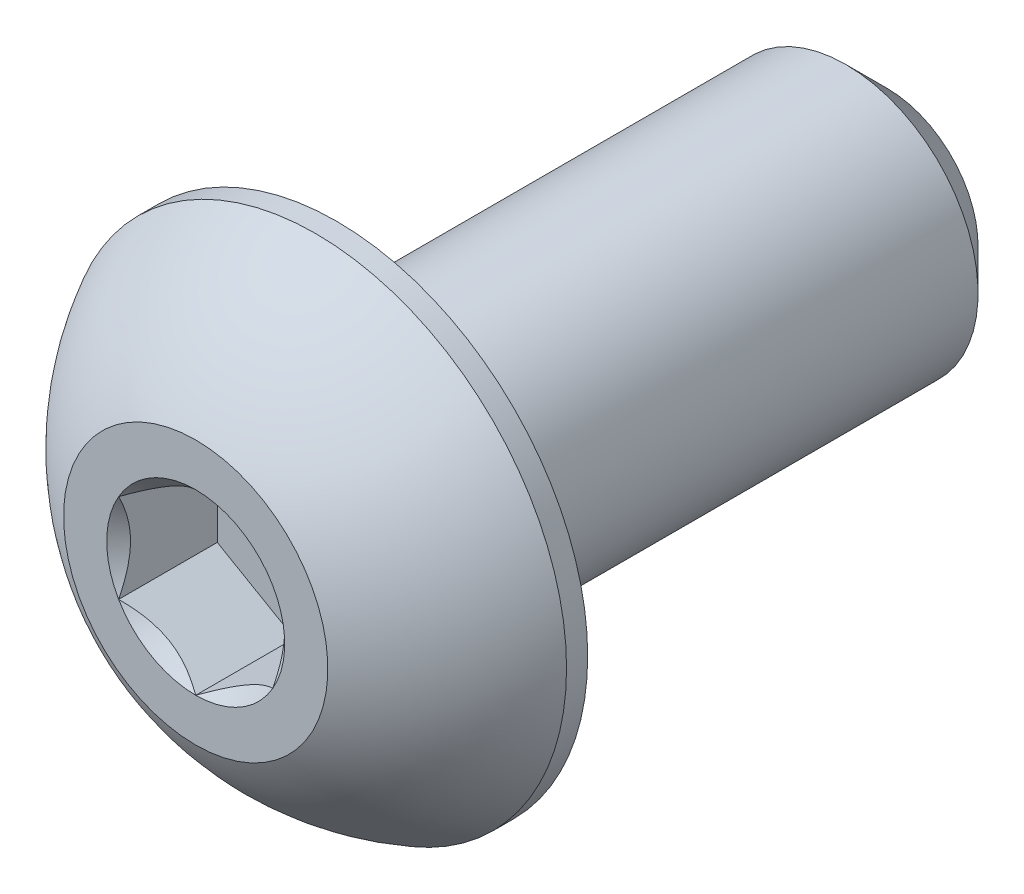
ISO-10303-21;
HEADER;
FILE_DESCRIPTION(('STEP AP214'),'2;1');
FILE_NAME('part.step','',(''),(''),'','','');
FILE_SCHEMA(('AUTOMOTIVE_DESIGN { 1 0 10303 214 1 1 1 1 }'));
ENDSEC;
DATA;
#1=APPLICATION_CONTEXT('core data for automotive mechanical design processes');
#2=APPLICATION_PROTOCOL_DEFINITION('international standard','automotive_design',2000,#1);
#3=PRODUCT_CONTEXT('',#1,'mechanical');
#4=PRODUCT('Part','Part','',(#3));
#5=PRODUCT_RELATED_PRODUCT_CATEGORY('part','',(#4));
#6=PRODUCT_DEFINITION_FORMATION('','',#4);
#7=PRODUCT_DEFINITION_CONTEXT('part definition',#1,'design');
#8=PRODUCT_DEFINITION('design','',#6,#7);
#9=PRODUCT_DEFINITION_SHAPE('','',#8);
#10=(LENGTH_UNIT() NAMED_UNIT(*) SI_UNIT(.MILLI.,.METRE.));
#11=(NAMED_UNIT(*) PLANE_ANGLE_UNIT() SI_UNIT($,.RADIAN.));
#12=(NAMED_UNIT(*) SI_UNIT($,.STERADIAN.) SOLID_ANGLE_UNIT());
#13=UNCERTAINTY_MEASURE_WITH_UNIT(LENGTH_MEASURE(1.E-05),#10,'distance_accuracy_value','');
#14=(GEOMETRIC_REPRESENTATION_CONTEXT(3) GLOBAL_UNCERTAINTY_ASSIGNED_CONTEXT((#13)) GLOBAL_UNIT_ASSIGNED_CONTEXT((#10,
#11,#12)) REPRESENTATION_CONTEXT('',''));
#15=CARTESIAN_POINT('',(0.,0.,0.));
#16=DIRECTION('',(0.,0.,1.));
#17=DIRECTION('',(1.,0.,0.));
#18=AXIS2_PLACEMENT_3D('',#15,#16,#17);
#19=CARTESIAN_POINT('',(0.,-0.762000000000003,-3.9878));
#20=DIRECTION('',(0.,0.,-1.));
#21=DIRECTION('',(0.,1.,0.));
#22=AXIS2_PLACEMENT_3D('',#19,#20,#21);
#23=PLANE('',#22);
#24=CARTESIAN_POINT('',(0.,0.,-3.9878));
#25=DIRECTION('',(0.,0.,-1.));
#26=DIRECTION('',(0.,1.,0.));
#27=AXIS2_PLACEMENT_3D('',#24,#25,#26);
#28=CIRCLE('',#27,0.523875000000002);
#29=CARTESIAN_POINT('',(0.,0.523875000000001,-3.9878));
#30=VERTEX_POINT('',#29);
#31=EDGE_CURVE('E174',#30,#30,#28,.T.);
#32=ORIENTED_EDGE('',*,*,#31,.T.);
#33=EDGE_LOOP('',(#32));
#34=FACE_BOUND('',#33,.T.);
#35=ADVANCED_FACE('F35',(#34),#23,.T.);
#36=CARTESIAN_POINT('',(0.,0.,-3.9878));
#37=DIRECTION('',(0.,0.,-1.));
#38=DIRECTION('',(0.,1.,0.));
#39=AXIS2_PLACEMENT_3D('',#36,#37,#38);
#40=CYLINDRICAL_SURFACE('',#39,0.762000000000002);
#41=CARTESIAN_POINT('',(0.,0.,-3.749675));
#42=DIRECTION('',(0.,0.,-1.));
#43=DIRECTION('',(0.,1.,0.));
#44=AXIS2_PLACEMENT_3D('',#41,#42,#43);
#45=CIRCLE('',#44,0.762000000000002);
#46=CARTESIAN_POINT('',(0.,0.762000000000001,-3.749675));
#47=VERTEX_POINT('',#46);
#48=EDGE_CURVE('E48',#47,#47,#45,.F.);
#49=ORIENTED_EDGE('',*,*,#48,.T.);
#50=EDGE_LOOP('',(#49));
#51=FACE_BOUND('',#50,.T.);
#52=CARTESIAN_POINT('',(0.,0.,-0.8128));
#53=DIRECTION('',(0.,0.,1.));
#54=DIRECTION('',(1.,0.,0.));
#55=AXIS2_PLACEMENT_3D('',#52,#53,#54);
#56=CIRCLE('',#55,0.762000000000002);
#57=CARTESIAN_POINT('',(0.762000000000002,0.,-0.8128));
#58=VERTEX_POINT('',#57);
#59=EDGE_CURVE('E171',#58,#58,#56,.F.);
#60=ORIENTED_EDGE('',*,*,#59,.T.);
#61=EDGE_LOOP('',(#60));
#62=FACE_BOUND('',#61,.T.);
#63=ADVANCED_FACE('F179',(#51,#62),#40,.T.);
#64=CARTESIAN_POINT('',(0.,0.,-3.9878));
#65=DIRECTION('',(0.,0.,1.));
#66=DIRECTION('',(0.,-1.,0.));
#67=AXIS2_PLACEMENT_3D('',#64,#65,#66);
#68=CONICAL_SURFACE('',#67,0.523875000000002,0.785398163397446);
#69=ORIENTED_EDGE('',*,*,#48,.F.);
#70=EDGE_LOOP('',(#69));
#71=FACE_BOUND('',#70,.T.);
#72=ORIENTED_EDGE('',*,*,#31,.F.);
#73=EDGE_LOOP('',(#72));
#74=FACE_BOUND('',#73,.T.);
#75=ADVANCED_FACE('F37',(#71,#74),#68,.T.);
#76=CARTESIAN_POINT('',(0.,0.,-1.44221573529412));
#77=DIRECTION('',(0.,0.,1.));
#78=DIRECTION('',(0.,-1.,0.));
#79=AXIS2_PLACEMENT_3D('',#76,#77,#78);
#80=SPHERICAL_SURFACE('',#79,1.63114384011035);
#81=CARTESIAN_POINT('',(0.,0.,0.));
#82=DIRECTION('',(0.,0.,1.));
#83=DIRECTION('',(1.,0.,0.));
#84=AXIS2_PLACEMENT_3D('',#81,#82,#83);
#85=CIRCLE('',#84,0.762000000000001);
#86=CARTESIAN_POINT('',(0.,-0.762000000000001,0.));
#87=VERTEX_POINT('',#86);
#88=EDGE_CURVE('E168',#87,#87,#85,.T.);
#89=CARTESIAN_POINT('',(0.,0.,-0.69088));
#90=DIRECTION('',(0.,0.,1.));
#91=DIRECTION('',(1.,0.,0.));
#92=AXIS2_PLACEMENT_3D('',#89,#90,#91);
#93=CIRCLE('',#92,1.4478);
#94=CARTESIAN_POINT('',(0.,-1.4478,-0.69088));
#95=VERTEX_POINT('',#94);
#96=EDGE_CURVE('E162',#95,#95,#93,.T.);
#97=CARTESIAN_POINT('',(0.,-0.762000000000001,0.));
#98=CARTESIAN_POINT('',(0.,-0.771104466379056,-0.00481036417026989));
#99=CARTESIAN_POINT('',(0.,-0.780163370263474,-0.00970696229692556));
#100=CARTESIAN_POINT('',(0.,-0.798186830704756,-0.0196708219968889));
#101=CARTESIAN_POINT('',(0.,-0.807151387261621,-0.0247380835701966));
#102=CARTESIAN_POINT('',(0.,-0.82498293070952,-0.0350414656973441));
#103=CARTESIAN_POINT('',(0.,-0.833849917600554,-0.0402775862511838));
#104=CARTESIAN_POINT('',(0.,-0.851483143439324,-0.0509168049100707));
#105=CARTESIAN_POINT('',(0.,-0.86024938238706,-0.0563199030151177));
#106=CARTESIAN_POINT('',(0.,-0.877677967766098,-0.0672911398543143));
#107=CARTESIAN_POINT('',(0.,-0.8863403141974,-0.0728592785884638));
#108=CARTESIAN_POINT('',(0.,-0.903558007883029,-0.0841585993934939));
#109=CARTESIAN_POINT('',(0.,-0.912113355137356,-0.0898897814643745));
#110=CARTESIAN_POINT('',(0.,-0.92911398200991,-0.101513133489628));
#111=CARTESIAN_POINT('',(0.,-0.937559261628137,-0.107405303444001));
#112=CARTESIAN_POINT('',(0.,-0.954336724292465,-0.119348517959269));
#113=CARTESIAN_POINT('',(0.,-0.962668907338566,-0.125399562520163));
#114=CARTESIAN_POINT('',(0.,-0.979217188472799,-0.137658356012908));
#115=CARTESIAN_POINT('',(0.,-0.98743328656093,-0.143866104944757));
#116=CARTESIAN_POINT('',(0.,-1.00374645103125,-0.156436080734891));
#117=CARTESIAN_POINT('',(0.,-1.01184351741343,-0.162798307593175));
#118=CARTESIAN_POINT('',(0.,-1.02791571441434,-0.175674957388929));
#119=CARTESIAN_POINT('',(0.,-1.03589084503307,-0.182189380326398));
#120=CARTESIAN_POINT('',(0.,-1.05171631018275,-0.195368085846875));
#121=CARTESIAN_POINT('',(0.,-1.0595666447137,-0.202032368429883));
#122=CARTESIAN_POINT('',(0.,-1.07513970212221,-0.215508403059926));
#123=CARTESIAN_POINT('',(0.,-1.08286242499978,-0.222320155106961));
#124=CARTESIAN_POINT('',(0.,-1.09817748930457,-0.236088685592779));
#125=CARTESIAN_POINT('',(0.,-1.1057698307318,-0.243045464031562));
#126=CARTESIAN_POINT('',(0.,-1.12082140910099,-0.257101552214098));
#127=CARTESIAN_POINT('',(0.,-1.12828064604295,-0.26420086195785));
#128=CARTESIAN_POINT('',(0.,-1.1430633401453,-0.278539466543903));
#129=CARTESIAN_POINT('',(0.,-1.1503867973057,-0.285778761386206));
#130=CARTESIAN_POINT('',(0.,-1.16489530524682,-0.300394739756518));
#131=CARTESIAN_POINT('',(0.,-1.17208035602754,-0.307771423284529));
#132=CARTESIAN_POINT('',(0.,-1.18630947425139,-0.322659533338212));
#133=CARTESIAN_POINT('',(0.,-1.19335354169453,-0.330170959863883));
#134=CARTESIAN_POINT('',(0.,-1.20729816684974,-0.345325861898523));
#135=CARTESIAN_POINT('',(0.,-1.21419872456182,-0.352969337407491));
#136=CARTESIAN_POINT('',(0.,-1.22785385533203,-0.368385596034267));
#137=CARTESIAN_POINT('',(0.,-1.23460842839015,-0.376158379152074));
#138=CARTESIAN_POINT('',(0.,-1.24796916728771,-0.391830465245191));
#139=CARTESIAN_POINT('',(0.,-1.25457533312716,-0.3997297682205));
#140=CARTESIAN_POINT('',(0.,-1.26763688824974,-0.415652060900225));
#141=CARTESIAN_POINT('',(0.,-1.27409227753288,-0.42367505060464));
#142=CARTESIAN_POINT('',(0.,-1.28684996428196,-0.439841839253321));
#143=CARTESIAN_POINT('',(0.,-1.29315226174789,-0.447985638197586));
#144=CARTESIAN_POINT('',(0.,-1.30560150450932,-0.464391124507575));
#145=CARTESIAN_POINT('',(0.,-1.3117484498048,-0.472652811873298));
#146=CARTESIAN_POINT('',(0.,-1.32388478358837,-0.48929111192737));
#147=CARTESIAN_POINT('',(0.,-1.32987417207644,-0.497667724615718));
#148=CARTESIAN_POINT('',(0.,-1.34169324412291,-0.514532870994296));
#149=CARTESIAN_POINT('',(0.,-1.34752292768131,-0.523021404684526));
#150=CARTESIAN_POINT('',(0.,-1.35902049900249,-0.540107348617399));
#151=CARTESIAN_POINT('',(0.,-1.36468838676526,-0.548704758860042));
#152=CARTESIAN_POINT('',(0.,-1.37586033374307,-0.566005372352988));
#153=CARTESIAN_POINT('',(0.,-1.3813643929581,-0.57470857560329));
#154=CARTESIAN_POINT('',(0.,-1.3922067085295,-0.592217653795651));
#155=CARTESIAN_POINT('',(0.,-1.39754496488588,-0.60102352873771));
#156=CARTESIAN_POINT('',(0.,-1.40805376107748,-0.618734791531648));
#157=CARTESIAN_POINT('',(0.,-1.41322430091272,-0.627640179383527));
#158=CARTESIAN_POINT('',(0.,-1.42339580613955,-0.645547275921293));
#159=CARTESIAN_POINT('',(0.,-1.42839677153115,-0.65454898460718));
#160=CARTESIAN_POINT('',(0.,-1.43822734723451,-0.672645487245523));
#161=CARTESIAN_POINT('',(0.,-1.44305695754627,-0.681740281197979));
#162=CARTESIAN_POINT('',(0.,-1.4478,-0.69088));
#163=B_SPLINE_CURVE_WITH_KNOTS('',3,(#97,#98,#99,#100,#101,#102,#103,#104,#105,#106,#107,#108,
#109,#110,#111,#112,#113,#114,#115,#116,#117,#118,#119,#120,#121,#122,#123,#124,#125,#126,#127,
#128,#129,#130,#131,#132,#133,#134,#135,#136,#137,#138,#139,#140,#141,#142,#143,#144,#145,#146,
#147,#148,#149,#150,#151,#152,#153,#154,#155,#156,#157,#158,#159,#160,#161,#162),.UNSPECIFIED.,
.F.,.F.,(4,2,2,2,2,2,2,2,2,2,2,2,2,2,2,2,2,2,2,2,2,2,2,2,2,2,2,2,2,2,2,2,4),(0.,
0.0308909313363183,0.0617818626726365,0.0926727940089552,0.123563725345273,0.154454656681592,
0.18534558801791,0.216236519354229,0.247127450690547,0.278018382026865,0.308909313363184,
0.339800244699502,0.370691176035821,0.401582107372139,0.432473038708457,0.463363970044776,
0.494254901381094,0.525145832717413,0.556036764053731,0.586927695390049,0.617818626726368,
0.648709558062686,0.679600489399005,0.710491420735323,0.741382352071641,0.77227328340796,
0.803164214744278,0.834055146080597,0.864946077416915,0.895837008753233,0.926727940089552,
0.95761887142587,0.988509802762189),.UNSPECIFIED.);
#164=EDGE_CURVE('BSEAM184',#87,#95,#163,.T.);
#165=ORIENTED_EDGE('',*,*,#88,.F.);
#166=ORIENTED_EDGE('',*,*,#96,.T.);
#167=ORIENTED_EDGE('',*,*,#164,.T.);
#168=ORIENTED_EDGE('',*,*,#164,.F.);
#169=EDGE_LOOP('',(#165,#167,#166,#168));
#170=FACE_BOUND('',#169,.T.);
#171=ADVANCED_FACE('F184',(#170),#80,.T.);
#172=CARTESIAN_POINT('',(0.,-0.762000000000001,0.));
#173=DIRECTION('',(0.,0.,-1.));
#174=DIRECTION('',(-1.,0.,0.));
#175=AXIS2_PLACEMENT_3D('',#172,#173,#174);
#176=PLANE('',#175);
#177=CARTESIAN_POINT('',(0.,0.,0.));
#178=DIRECTION('',(0.,0.,1.));
#179=DIRECTION('',(1.,0.,0.));
#180=AXIS2_PLACEMENT_3D('',#177,#178,#179);
#181=CIRCLE('',#180,0.513264389309577);
#182=CARTESIAN_POINT('',(-0.4445,0.256632194654788,0.));
#183=VERTEX_POINT('',#182);
#184=CARTESIAN_POINT('',(-0.4445,-0.256632194654789,0.));
#185=VERTEX_POINT('',#184);
#186=EDGE_CURVE('E61',#183,#185,#181,.T.);
#187=ORIENTED_EDGE('',*,*,#186,.F.);
#188=CARTESIAN_POINT('',(0.,0.513264389309577,0.));
#189=VERTEX_POINT('',#188);
#190=EDGE_CURVE('E133',#189,#183,#181,.T.);
#191=ORIENTED_EDGE('',*,*,#190,.F.);
#192=CARTESIAN_POINT('',(0.4445,0.256632194654788,0.));
#193=VERTEX_POINT('',#192);
#194=EDGE_CURVE('E130',#193,#189,#181,.T.);
#195=ORIENTED_EDGE('',*,*,#194,.F.);
#196=CARTESIAN_POINT('',(0.4445,-0.256632194654788,0.));
#197=VERTEX_POINT('',#196);
#198=EDGE_CURVE('E101',#197,#193,#181,.T.);
#199=ORIENTED_EDGE('',*,*,#198,.F.);
#200=CARTESIAN_POINT('',(0.,-0.513264389309577,0.));
#201=VERTEX_POINT('',#200);
#202=EDGE_CURVE('E93',#201,#197,#181,.T.);
#203=ORIENTED_EDGE('',*,*,#202,.F.);
#204=EDGE_CURVE('E54',#185,#201,#181,.T.);
#205=ORIENTED_EDGE('',*,*,#204,.F.);
#206=EDGE_LOOP('',(#187,#191,#195,#199,#203,#205));
#207=FACE_BOUND('',#206,.T.);
#208=ORIENTED_EDGE('',*,*,#88,.T.);
#209=EDGE_LOOP('',(#208));
#210=FACE_BOUND('',#209,.T.);
#211=ADVANCED_FACE('F127',(#207,#210),#176,.F.);
#212=CARTESIAN_POINT('',(0.,-1.4478,-0.8128));
#213=DIRECTION('',(0.,0.,1.));
#214=DIRECTION('',(1.,0.,0.));
#215=AXIS2_PLACEMENT_3D('',#212,#213,#214);
#216=PLANE('',#215);
#217=ORIENTED_EDGE('',*,*,#59,.F.);
#218=EDGE_LOOP('',(#217));
#219=FACE_BOUND('',#218,.T.);
#220=CARTESIAN_POINT('',(0.,0.,-0.8128));
#221=DIRECTION('',(0.,0.,1.));
#222=DIRECTION('',(1.,0.,0.));
#223=AXIS2_PLACEMENT_3D('',#220,#221,#222);
#224=CIRCLE('',#223,1.4478);
#225=CARTESIAN_POINT('',(1.4478,0.,-0.8128));
#226=VERTEX_POINT('',#225);
#227=EDGE_CURVE('E165',#226,#226,#224,.T.);
#228=ORIENTED_EDGE('',*,*,#227,.F.);
#229=EDGE_LOOP('',(#228));
#230=FACE_BOUND('',#229,.T.);
#231=ADVANCED_FACE('F198',(#219,#230),#216,.F.);
#232=CARTESIAN_POINT('',(0.,0.,0.));
#233=DIRECTION('',(0.,0.,1.));
#234=DIRECTION('',(1.,0.,0.));
#235=AXIS2_PLACEMENT_3D('',#232,#233,#234);
#236=CYLINDRICAL_SURFACE('',#235,1.4478);
#237=ORIENTED_EDGE('',*,*,#96,.F.);
#238=EDGE_LOOP('',(#237));
#239=FACE_BOUND('',#238,.T.);
#240=ORIENTED_EDGE('',*,*,#227,.T.);
#241=EDGE_LOOP('',(#240));
#242=FACE_BOUND('',#241,.T.);
#243=ADVANCED_FACE('F201',(#239,#242),#236,.T.);
#244=CARTESIAN_POINT('',(0.,0.,0.));
#245=DIRECTION('',(0.,0.,1.));
#246=DIRECTION('',(1.,0.,0.));
#247=AXIS2_PLACEMENT_3D('',#244,#245,#246);
#248=CONICAL_SURFACE('',#247,0.513264389309577,0.78539816339745);
#249=ORIENTED_EDGE('',*,*,#198,.T.);
#250=CARTESIAN_POINT('',(0.4445,-0.511829342433521,0.164636433654911));
#251=CARTESIAN_POINT('',(0.4445,-0.486891084889183,0.145850439034892));
#252=CARTESIAN_POINT('',(0.4445,-0.461691007430873,0.127376504524434));
#253=CARTESIAN_POINT('',(0.4445,-0.410329660721342,0.0913821506785367));
#254=CARTESIAN_POINT('',(0.4445,-0.384162428854917,0.0738702894197705));
#255=CARTESIAN_POINT('',(0.4445,-0.329287980819696,0.0394830646726668));
#256=CARTESIAN_POINT('',(0.4445,-0.300521037965711,0.0227010852101707));
#257=CARTESIAN_POINT('',(0.4445,-0.241568559840238,-0.00798919318724003));
#258=CARTESIAN_POINT('',(0.4445,-0.211388245708777,-0.021907180298281));
#259=CARTESIAN_POINT('',(0.4445,-0.151771739698241,-0.0443091437045172));
#260=CARTESIAN_POINT('',(0.4445,-0.122473115330602,-0.0531418272601864));
#261=CARTESIAN_POINT('',(0.4445,-0.0632241889330753,-0.0651998432578627));
#262=CARTESIAN_POINT('',(0.4445,-0.0332958391310468,-0.0685254888106565));
#263=CARTESIAN_POINT('',(0.4445,0.0255238480886847,-0.0689699422155929));
#264=CARTESIAN_POINT('',(0.4445,0.0544135352957962,-0.0663089249782688));
#265=CARTESIAN_POINT('',(0.4445,0.111708480695749,-0.0558322082716233));
#266=CARTESIAN_POINT('',(0.4445,0.14009591628793,-0.0479254436301723));
#267=CARTESIAN_POINT('',(0.4445,0.198086494530433,-0.0274558455981967));
#268=CARTESIAN_POINT('',(0.4445,0.227553507232478,-0.0145255330817329));
#269=CARTESIAN_POINT('',(0.4445,0.285120497610206,0.0142304674054823));
#270=CARTESIAN_POINT('',(0.4445,0.313215089215117,0.0300665579926028));
#271=CARTESIAN_POINT('',(0.4445,0.366904764676342,0.0627272409140941));
#272=CARTESIAN_POINT('',(0.4445,0.392554679985773,0.0794636064084331));
#273=CARTESIAN_POINT('',(0.4445,0.442864748703385,0.113944645995348));
#274=CARTESIAN_POINT('',(0.4445,0.467531279975358,0.131679956954853));
#275=CARTESIAN_POINT('',(0.4445,0.491928973864434,0.149739656927936));
#276=B_SPLINE_CURVE_WITH_KNOTS('',3,(#250,#251,#252,#253,#254,#255,#256,#257,#258,#259,#260,
#261,#262,#263,#264,#265,#266,#267,#268,#269,#270,#271,#272,#273,#274,#275),.UNSPECIFIED.,.F.,
.F.,(4,2,2,2,2,2,2,2,2,2,2,2,4),(0.,0.0936965174450125,0.188123619017623,0.287940507610602,
0.387413978831584,0.47883421881895,0.56857010680405,0.655059880285826,0.743091820256314,
0.839389678312887,0.936039255964513,1.02788603853754,1.11898185125655),.UNSPECIFIED.);
#277=EDGE_CURVE('E11',#197,#193,#276,.T.);
#278=ORIENTED_EDGE('',*,*,#277,.F.);
#279=EDGE_LOOP('',(#249,#278));
#280=FACE_BOUND('',#279,.T.);
#281=ADVANCED_FACE('F105',(#280),#248,.F.);
#282=ORIENTED_EDGE('',*,*,#194,.T.);
#283=CARTESIAN_POINT('',(0.4447,0.256516724600951,0.000115509011344658));
#284=CARTESIAN_POINT('',(0.429409571788146,0.265344657445089,-0.00870889942122965));
#285=CARTESIAN_POINT('',(0.413864397926238,0.274319667758861,-0.0170163019957356));
#286=CARTESIAN_POINT('',(0.382165477828726,0.29262104781018,-0.0322278235174474));
#287=CARTESIAN_POINT('',(0.36600870800995,0.301949163214285,-0.0391234650204188));
#288=CARTESIAN_POINT('',(0.333427178808648,0.320760117869267,-0.0509346709016412));
#289=CARTESIAN_POINT('',(0.317010773157777,0.330238134090923,-0.0558799934684637));
#290=CARTESIAN_POINT('',(0.283824180352226,0.349398422380694,-0.0635057467144074));
#291=CARTESIAN_POINT('',(0.267054990523428,0.359080118642443,-0.06619186144708));
#292=CARTESIAN_POINT('',(0.226101210237747,0.382724794714713,-0.0695994052943336));
#293=CARTESIAN_POINT('',(0.201820988504441,0.396742987268422,-0.068984022738946));
#294=CARTESIAN_POINT('',(0.153769357705213,0.424485609245357,-0.06263644768087));
#295=CARTESIAN_POINT('',(0.129998763413685,0.438209568258367,-0.0568966083958371));
#296=CARTESIAN_POINT('',(0.0882404335887596,0.462318751223697,-0.0430500842413838));
#297=CARTESIAN_POINT('',(0.0700612261888539,0.472814521509687,-0.0356638940518456));
#298=CARTESIAN_POINT('',(0.0344155366813067,0.493394569942319,-0.0190236577818608));
#299=CARTESIAN_POINT('',(0.0169469534567807,0.503480061169361,-0.00977568551988066));
#300=CARTESIAN_POINT('',(-0.000200000000000065,0.513379859363415,0.000115509011344519));
#301=B_SPLINE_CURVE_WITH_KNOTS('',3,(#283,#284,#285,#286,#287,#288,#289,#290,#291,#292,#293,
#294,#295,#296,#297,#298,#299,#300),.UNSPECIFIED.,.F.,.F.,(4,2,2,2,2,2,2,2,4),(0.,
0.059254574139977,0.118855153084928,0.177507465081246,0.236011765586856,0.319609015700825,
0.403331219627383,0.46999563216221,0.536445986043465),.UNSPECIFIED.);
#302=EDGE_CURVE('E132',#193,#189,#301,.T.);
#303=ORIENTED_EDGE('',*,*,#302,.F.);
#304=EDGE_LOOP('',(#282,#303));
#305=FACE_BOUND('',#304,.T.);
#306=ADVANCED_FACE('F281',(#305),#248,.F.);
#307=ORIENTED_EDGE('',*,*,#190,.T.);
#308=CARTESIAN_POINT('',(0.000199999999999894,0.513379859363415,0.00011550901134442));
#309=CARTESIAN_POINT('',(-0.0150904282118541,0.504551926519277,-0.00870889942122972));
#310=CARTESIAN_POINT('',(-0.0306356020737623,0.495576916205504,-0.0170163019957356));
#311=CARTESIAN_POINT('',(-0.0623345221712741,0.477275536154185,-0.0322278235174474));
#312=CARTESIAN_POINT('',(-0.0784912919900499,0.46794742075008,-0.0391234650204189));
#313=CARTESIAN_POINT('',(-0.111072821191352,0.449136466095099,-0.0509346709016413));
#314=CARTESIAN_POINT('',(-0.127489226842223,0.439658449873443,-0.0558799934684636));
#315=CARTESIAN_POINT('',(-0.160675819647773,0.420498161583671,-0.0635057467144074));
#316=CARTESIAN_POINT('',(-0.177445009476572,0.410816465321923,-0.06619186144708));
#317=CARTESIAN_POINT('',(-0.218398789762252,0.387171789249652,-0.0695994052943337));
#318=CARTESIAN_POINT('',(-0.242679011495559,0.373153596695944,-0.068984022738946));
#319=CARTESIAN_POINT('',(-0.290730642294787,0.345410974719009,-0.0626364476808701));
#320=CARTESIAN_POINT('',(-0.314501236586314,0.331687015705998,-0.0568966083958371));
#321=CARTESIAN_POINT('',(-0.35625956641124,0.307577832740668,-0.0430500842413839));
#322=CARTESIAN_POINT('',(-0.374438773811146,0.297082062454679,-0.0356638940518458));
#323=CARTESIAN_POINT('',(-0.410084463318693,0.276502014022046,-0.0190236577818609));
#324=CARTESIAN_POINT('',(-0.427553046543219,0.266416522795005,-0.00977568551988078));
#325=CARTESIAN_POINT('',(-0.4447,0.256516724600951,0.000115509011344493));
#326=B_SPLINE_CURVE_WITH_KNOTS('',3,(#308,#309,#310,#311,#312,#313,#314,#315,#316,#317,#318,
#319,#320,#321,#322,#323,#324,#325),.UNSPECIFIED.,.F.,.F.,(4,2,2,2,2,2,2,2,4),(0.,
0.0592545741399768,0.118855153084928,0.177507465081246,0.236011765586855,0.319609015700824,
0.403331219627383,0.46999563216221,0.536445986043464),.UNSPECIFIED.);
#327=EDGE_CURVE('E137',#189,#183,#326,.T.);
#328=ORIENTED_EDGE('',*,*,#327,.F.);
#329=EDGE_LOOP('',(#307,#328));
#330=FACE_BOUND('',#329,.T.);
#331=ADVANCED_FACE('F140',(#330),#248,.F.);
#332=ORIENTED_EDGE('',*,*,#186,.T.);
#333=CARTESIAN_POINT('',(-0.4445,-0.511829342433522,0.164636433654911));
#334=CARTESIAN_POINT('',(-0.4445,-0.486891084889183,0.145850439034892));
#335=CARTESIAN_POINT('',(-0.4445,-0.461691007430873,0.127376504524434));
#336=CARTESIAN_POINT('',(-0.4445,-0.410329660721343,0.0913821506785367));
#337=CARTESIAN_POINT('',(-0.4445,-0.384162428854917,0.0738702894197704));
#338=CARTESIAN_POINT('',(-0.4445,-0.329287980819697,0.0394830646726667));
#339=CARTESIAN_POINT('',(-0.4445,-0.300521037965712,0.0227010852101706));
#340=CARTESIAN_POINT('',(-0.4445,-0.241568559840238,-0.00798919318724017));
#341=CARTESIAN_POINT('',(-0.4445,-0.211388245708777,-0.0219071802982811));
#342=CARTESIAN_POINT('',(-0.4445,-0.151771739698241,-0.0443091437045174));
#343=CARTESIAN_POINT('',(-0.4445,-0.122473115330602,-0.0531418272601866));
#344=CARTESIAN_POINT('',(-0.4445,-0.0632241889330757,-0.0651998432578629));
#345=CARTESIAN_POINT('',(-0.4445,-0.0332958391310472,-0.0685254888106567));
#346=CARTESIAN_POINT('',(-0.4445,0.0255238480886843,-0.0689699422155931));
#347=CARTESIAN_POINT('',(-0.4445,0.0544135352957959,-0.066308924978269));
#348=CARTESIAN_POINT('',(-0.4445,0.111708480695749,-0.0558322082716234));
#349=CARTESIAN_POINT('',(-0.4445,0.140095916287929,-0.0479254436301725));
#350=CARTESIAN_POINT('',(-0.4445,0.198086494530433,-0.027455845598197));
#351=CARTESIAN_POINT('',(-0.4445,0.227553507232478,-0.0145255330817332));
#352=CARTESIAN_POINT('',(-0.4445,0.285120497610205,0.0142304674054819));
#353=CARTESIAN_POINT('',(-0.4445,0.313215089215117,0.0300665579926024));
#354=CARTESIAN_POINT('',(-0.4445,0.366904764676342,0.0627272409140938));
#355=CARTESIAN_POINT('',(-0.4445,0.392554679985773,0.0794636064084327));
#356=CARTESIAN_POINT('',(-0.4445,0.442864748703384,0.113944645995348));
#357=CARTESIAN_POINT('',(-0.4445,0.467531279975358,0.131679956954853));
#358=CARTESIAN_POINT('',(-0.4445,0.491928973864433,0.149739656927935));
#359=B_SPLINE_CURVE_WITH_KNOTS('',3,(#333,#334,#335,#336,#337,#338,#339,#340,#341,#342,#343,
#344,#345,#346,#347,#348,#349,#350,#351,#352,#353,#354,#355,#356,#357,#358),.UNSPECIFIED.,.F.,
.F.,(4,2,2,2,2,2,2,2,2,2,2,2,4),(0.,0.0936965174450127,0.188123619017623,0.287940507610602,
0.387413978831584,0.47883421881895,0.56857010680405,0.655059880285827,0.743091820256315,
0.839389678312887,0.936039255964514,1.02788603853754,1.11898185125655),.UNSPECIFIED.);
#360=EDGE_CURVE('E144',#183,#185,#359,.F.);
#361=ORIENTED_EDGE('',*,*,#360,.F.);
#362=EDGE_LOOP('',(#332,#361));
#363=FACE_BOUND('',#362,.T.);
#364=ADVANCED_FACE('F275',(#363),#248,.F.);
#365=ORIENTED_EDGE('',*,*,#204,.T.);
#366=CARTESIAN_POINT('',(-0.4447,-0.256516724600951,0.000115509011344333));
#367=CARTESIAN_POINT('',(-0.429409571788146,-0.265344657445089,-0.00870889942122991));
#368=CARTESIAN_POINT('',(-0.413864397926238,-0.274319667758861,-0.0170163019957358));
#369=CARTESIAN_POINT('',(-0.382165477828726,-0.29262104781018,-0.0322278235174476));
#370=CARTESIAN_POINT('',(-0.36600870800995,-0.301949163214285,-0.039123465020419));
#371=CARTESIAN_POINT('',(-0.333427178808648,-0.320760117869267,-0.0509346709016414));
#372=CARTESIAN_POINT('',(-0.317010773157777,-0.330238134090923,-0.0558799934684638));
#373=CARTESIAN_POINT('',(-0.283824180352227,-0.349398422380694,-0.0635057467144075));
#374=CARTESIAN_POINT('',(-0.267054990523428,-0.359080118642443,-0.0661918614470801));
#375=CARTESIAN_POINT('',(-0.226101210237748,-0.382724794714713,-0.0695994052943337));
#376=CARTESIAN_POINT('',(-0.201820988504441,-0.396742987268422,-0.068984022738946));
#377=CARTESIAN_POINT('',(-0.153769357705213,-0.424485609245356,-0.0626364476808701));
#378=CARTESIAN_POINT('',(-0.129998763413686,-0.438209568258367,-0.0568966083958371));
#379=CARTESIAN_POINT('',(-0.0882404335887599,-0.462318751223697,-0.043050084241384));
#380=CARTESIAN_POINT('',(-0.070061226188854,-0.472814521509687,-0.0356638940518458));
#381=CARTESIAN_POINT('',(-0.0344155366813067,-0.493394569942319,-0.0190236577818609));
#382=CARTESIAN_POINT('',(-0.0169469534567806,-0.503480061169361,-0.00977568551988075));
#383=CARTESIAN_POINT('',(0.000200000000000104,-0.513379859363415,0.000115509011344519));
#384=B_SPLINE_CURVE_WITH_KNOTS('',3,(#366,#367,#368,#369,#370,#371,#372,#373,#374,#375,#376,
#377,#378,#379,#380,#381,#382,#383),.UNSPECIFIED.,.F.,.F.,(4,2,2,2,2,2,2,2,4),(0.,
0.0592545741399768,0.118855153084928,0.177507465081246,0.236011765586855,0.319609015700824,
0.403331219627383,0.469995632162209,0.536445986043464),.UNSPECIFIED.);
#385=EDGE_CURVE('E117',#185,#201,#384,.T.);
#386=ORIENTED_EDGE('',*,*,#385,.F.);
#387=EDGE_LOOP('',(#365,#386));
#388=FACE_BOUND('',#387,.T.);
#389=ADVANCED_FACE('F226',(#388),#248,.F.);
#390=ORIENTED_EDGE('',*,*,#202,.T.);
#391=CARTESIAN_POINT('',(-0.00019999999999989,-0.513379859363415,0.00011550901134442));
#392=CARTESIAN_POINT('',(0.015090428211854,-0.504551926519277,-0.00870889942122976));
#393=CARTESIAN_POINT('',(0.0306356020737623,-0.495576916205504,-0.0170163019957357));
#394=CARTESIAN_POINT('',(0.0623345221712741,-0.477275536154185,-0.0322278235174475));
#395=CARTESIAN_POINT('',(0.07849129199005,-0.46794742075008,-0.0391234650204189));
#396=CARTESIAN_POINT('',(0.111072821191352,-0.449136466095099,-0.0509346709016413));
#397=CARTESIAN_POINT('',(0.127489226842223,-0.439658449873443,-0.0558799934684638));
#398=CARTESIAN_POINT('',(0.160675819647773,-0.420498161583671,-0.0635057467144075));
#399=CARTESIAN_POINT('',(0.177445009476572,-0.410816465321923,-0.06619186144708));
#400=CARTESIAN_POINT('',(0.218398789762252,-0.387171789249652,-0.0695994052943337));
#401=CARTESIAN_POINT('',(0.242679011495559,-0.373153596695944,-0.068984022738946));
#402=CARTESIAN_POINT('',(0.290730642294787,-0.345410974719009,-0.0626364476808702));
#403=CARTESIAN_POINT('',(0.314501236586314,-0.331687015705998,-0.0568966083958372));
#404=CARTESIAN_POINT('',(0.35625956641124,-0.307577832740668,-0.043050084241384));
#405=CARTESIAN_POINT('',(0.374438773811146,-0.297082062454679,-0.0356638940518458));
#406=CARTESIAN_POINT('',(0.410084463318693,-0.276502014022046,-0.0190236577818609));
#407=CARTESIAN_POINT('',(0.427553046543219,-0.266416522795005,-0.00977568551988079));
#408=CARTESIAN_POINT('',(0.4447,-0.25651672460095,0.00011550901134454));
#409=B_SPLINE_CURVE_WITH_KNOTS('',3,(#391,#392,#393,#394,#395,#396,#397,#398,#399,#400,#401,
#402,#403,#404,#405,#406,#407,#408),.UNSPECIFIED.,.F.,.F.,(4,2,2,2,2,2,2,2,4),(0.,
0.0592545741399769,0.118855153084928,0.177507465081246,0.236011765586855,0.319609015700824,
0.403331219627383,0.46999563216221,0.536445986043465),.UNSPECIFIED.);
#410=EDGE_CURVE('E97',#201,#197,#409,.T.);
#411=ORIENTED_EDGE('',*,*,#410,.F.);
#412=EDGE_LOOP('',(#390,#411));
#413=FACE_BOUND('',#412,.T.);
#414=ADVANCED_FACE('F95',(#413),#248,.F.);
#415=CARTESIAN_POINT('',(0.4445,-0.256632194654788,-0.56896));
#416=DIRECTION('',(0.,0.,1.));
#417=DIRECTION('',(1.,0.,0.));
#418=AXIS2_PLACEMENT_3D('',#415,#416,#417);
#419=PLANE('',#418);
#420=DIRECTION('',(0.866025403784438,0.5,0.));
#421=VECTOR('',#420,1.);
#422=CARTESIAN_POINT('',(0.,-0.513264389309577,-0.56896));
#423=LINE('',#422,#421);
#424=CARTESIAN_POINT('',(0.,-0.513264389309577,-0.56896));
#425=VERTEX_POINT('',#424);
#426=CARTESIAN_POINT('',(0.4445,-0.256632194654788,-0.56896));
#427=VERTEX_POINT('',#426);
#428=EDGE_CURVE('E116',#425,#427,#423,.T.);
#429=ORIENTED_EDGE('',*,*,#428,.T.);
#430=DIRECTION('',(0.,1.,0.));
#431=VECTOR('',#430,1.);
#432=CARTESIAN_POINT('',(0.4445,-0.256632194654788,-0.56896));
#433=LINE('',#432,#431);
#434=CARTESIAN_POINT('',(0.4445,0.256632194654789,-0.56896));
#435=VERTEX_POINT('',#434);
#436=EDGE_CURVE('E121',#427,#435,#433,.T.);
#437=ORIENTED_EDGE('',*,*,#436,.T.);
#438=DIRECTION('',(-0.866025403784439,0.5,0.));
#439=VECTOR('',#438,1.);
#440=CARTESIAN_POINT('',(0.4445,0.256632194654789,-0.56896));
#441=LINE('',#440,#439);
#442=CARTESIAN_POINT('',(0.,0.513264389309577,-0.56896));
#443=VERTEX_POINT('',#442);
#444=EDGE_CURVE('E265',#435,#443,#441,.T.);
#445=ORIENTED_EDGE('',*,*,#444,.T.);
#446=DIRECTION('',(-0.866025403784439,-0.5,0.));
#447=VECTOR('',#446,1.);
#448=CARTESIAN_POINT('',(0.,0.513264389309577,-0.56896));
#449=LINE('',#448,#447);
#450=CARTESIAN_POINT('',(-0.4445,0.256632194654788,-0.56896));
#451=VERTEX_POINT('',#450);
#452=EDGE_CURVE('E153',#443,#451,#449,.T.);
#453=ORIENTED_EDGE('',*,*,#452,.T.);
#454=DIRECTION('',(0.,-1.,0.));
#455=VECTOR('',#454,1.);
#456=CARTESIAN_POINT('',(-0.4445,0.256632194654788,-0.56896));
#457=LINE('',#456,#455);
#458=CARTESIAN_POINT('',(-0.4445,-0.256632194654789,-0.56896));
#459=VERTEX_POINT('',#458);
#460=EDGE_CURVE('E269',#451,#459,#457,.T.);
#461=ORIENTED_EDGE('',*,*,#460,.T.);
#462=DIRECTION('',(0.866025403784439,-0.5,0.));
#463=VECTOR('',#462,1.);
#464=CARTESIAN_POINT('',(-0.4445,-0.256632194654789,-0.56896));
#465=LINE('',#464,#463);
#466=EDGE_CURVE('E124',#459,#425,#465,.T.);
#467=ORIENTED_EDGE('',*,*,#466,.T.);
#468=EDGE_LOOP('',(#429,#437,#445,#453,#461,#467));
#469=FACE_BOUND('',#468,.T.);
#470=ADVANCED_FACE('F225',(#469),#419,.T.);
#471=CARTESIAN_POINT('',(0.4445,-0.256632194654788,-0.56896));
#472=DIRECTION('',(1.,0.,0.));
#473=DIRECTION('',(0.,0.,-1.));
#474=AXIS2_PLACEMENT_3D('',#471,#472,#473);
#475=PLANE('',#474);
#476=DIRECTION('',(0.,0.,1.));
#477=VECTOR('',#476,1.);
#478=CARTESIAN_POINT('',(0.4445,-0.256632194654788,-0.56896));
#479=LINE('',#478,#477);
#480=EDGE_CURVE('E113',#427,#197,#479,.T.);
#481=ORIENTED_EDGE('',*,*,#480,.T.);
#482=ORIENTED_EDGE('',*,*,#277,.T.);
#483=DIRECTION('',(0.,0.,1.));
#484=VECTOR('',#483,1.);
#485=CARTESIAN_POINT('',(0.4445,0.256632194654789,-0.56896));
#486=LINE('',#485,#484);
#487=EDGE_CURVE('E123',#435,#193,#486,.T.);
#488=ORIENTED_EDGE('',*,*,#487,.F.);
#489=ORIENTED_EDGE('',*,*,#436,.F.);
#490=EDGE_LOOP('',(#481,#482,#488,#489));
#491=FACE_BOUND('',#490,.T.);
#492=ADVANCED_FACE('F119',(#491),#475,.F.);
#493=CARTESIAN_POINT('',(0.4445,0.256632194654789,-0.56896));
#494=DIRECTION('',(0.5,0.866025403784439,0.));
#495=DIRECTION('',(-0.866025403784439,0.5,0.));
#496=AXIS2_PLACEMENT_3D('',#493,#494,#495);
#497=PLANE('',#496);
#498=ORIENTED_EDGE('',*,*,#487,.T.);
#499=ORIENTED_EDGE('',*,*,#302,.T.);
#500=DIRECTION('',(0.,0.,1.));
#501=VECTOR('',#500,1.);
#502=CARTESIAN_POINT('',(0.,0.513264389309577,-0.56896));
#503=LINE('',#502,#501);
#504=EDGE_CURVE('E149',#443,#189,#503,.T.);
#505=ORIENTED_EDGE('',*,*,#504,.F.);
#506=ORIENTED_EDGE('',*,*,#444,.F.);
#507=EDGE_LOOP('',(#498,#499,#505,#506));
#508=FACE_BOUND('',#507,.T.);
#509=ADVANCED_FACE('F147',(#508),#497,.F.);
#510=CARTESIAN_POINT('',(0.,0.513264389309577,-0.56896));
#511=DIRECTION('',(-0.5,0.866025403784438,0.));
#512=DIRECTION('',(-0.866025403784439,-0.5,0.));
#513=AXIS2_PLACEMENT_3D('',#510,#511,#512);
#514=PLANE('',#513);
#515=ORIENTED_EDGE('',*,*,#504,.T.);
#516=ORIENTED_EDGE('',*,*,#327,.T.);
#517=DIRECTION('',(0.,0.,1.));
#518=VECTOR('',#517,1.);
#519=CARTESIAN_POINT('',(-0.4445,0.256632194654788,-0.56896));
#520=LINE('',#519,#518);
#521=EDGE_CURVE('E155',#451,#183,#520,.T.);
#522=ORIENTED_EDGE('',*,*,#521,.F.);
#523=ORIENTED_EDGE('',*,*,#452,.F.);
#524=EDGE_LOOP('',(#515,#516,#522,#523));
#525=FACE_BOUND('',#524,.T.);
#526=ADVANCED_FACE('F151',(#525),#514,.F.);
#527=CARTESIAN_POINT('',(-0.4445,0.256632194654788,-0.56896));
#528=DIRECTION('',(-1.,0.,0.));
#529=DIRECTION('',(0.,-1.,0.));
#530=AXIS2_PLACEMENT_3D('',#527,#528,#529);
#531=PLANE('',#530);
#532=ORIENTED_EDGE('',*,*,#521,.T.);
#533=ORIENTED_EDGE('',*,*,#360,.T.);
#534=DIRECTION('',(0.,0.,1.));
#535=VECTOR('',#534,1.);
#536=CARTESIAN_POINT('',(-0.4445,-0.256632194654789,-0.56896));
#537=LINE('',#536,#535);
#538=EDGE_CURVE('E157',#459,#185,#537,.T.);
#539=ORIENTED_EDGE('',*,*,#538,.F.);
#540=ORIENTED_EDGE('',*,*,#460,.F.);
#541=EDGE_LOOP('',(#532,#533,#539,#540));
#542=FACE_BOUND('',#541,.T.);
#543=ADVANCED_FACE('F244',(#542),#531,.F.);
#544=CARTESIAN_POINT('',(-0.4445,-0.256632194654789,-0.56896));
#545=DIRECTION('',(-0.5,-0.866025403784438,0.));
#546=DIRECTION('',(0.866025403784439,-0.5,0.));
#547=AXIS2_PLACEMENT_3D('',#544,#545,#546);
#548=PLANE('',#547);
#549=ORIENTED_EDGE('',*,*,#538,.T.);
#550=ORIENTED_EDGE('',*,*,#385,.T.);
#551=DIRECTION('',(0.,0.,1.));
#552=VECTOR('',#551,1.);
#553=CARTESIAN_POINT('',(0.,-0.513264389309577,-0.56896));
#554=LINE('',#553,#552);
#555=EDGE_CURVE('E115',#425,#201,#554,.T.);
#556=ORIENTED_EDGE('',*,*,#555,.F.);
#557=ORIENTED_EDGE('',*,*,#466,.F.);
#558=EDGE_LOOP('',(#549,#550,#556,#557));
#559=FACE_BOUND('',#558,.T.);
#560=ADVANCED_FACE('F208',(#559),#548,.F.);
#561=CARTESIAN_POINT('',(0.,-0.513264389309577,-0.56896));
#562=DIRECTION('',(0.5,-0.866025403784438,0.));
#563=DIRECTION('',(0.866025403784439,0.5,0.));
#564=AXIS2_PLACEMENT_3D('',#561,#562,#563);
#565=PLANE('',#564);
#566=ORIENTED_EDGE('',*,*,#555,.T.);
#567=ORIENTED_EDGE('',*,*,#410,.T.);
#568=ORIENTED_EDGE('',*,*,#480,.F.);
#569=ORIENTED_EDGE('',*,*,#428,.F.);
#570=EDGE_LOOP('',(#566,#567,#568,#569));
#571=FACE_BOUND('',#570,.T.);
#572=ADVANCED_FACE('F111',(#571),#565,.F.);
#573=CLOSED_SHELL('',(#35,#63,#75,#171,#211,#231,#243,#281,#306,#331,#364,#389,#414,#470,#492,
#509,#526,#543,#560,#572));
#574=MANIFOLD_SOLID_BREP('B2',#573);
#575=ADVANCED_BREP_SHAPE_REPRESENTATION('',(#18,#574),#14);
#576=SHAPE_DEFINITION_REPRESENTATION(#9,#575);
ENDSEC;
END-ISO-10303-21;
